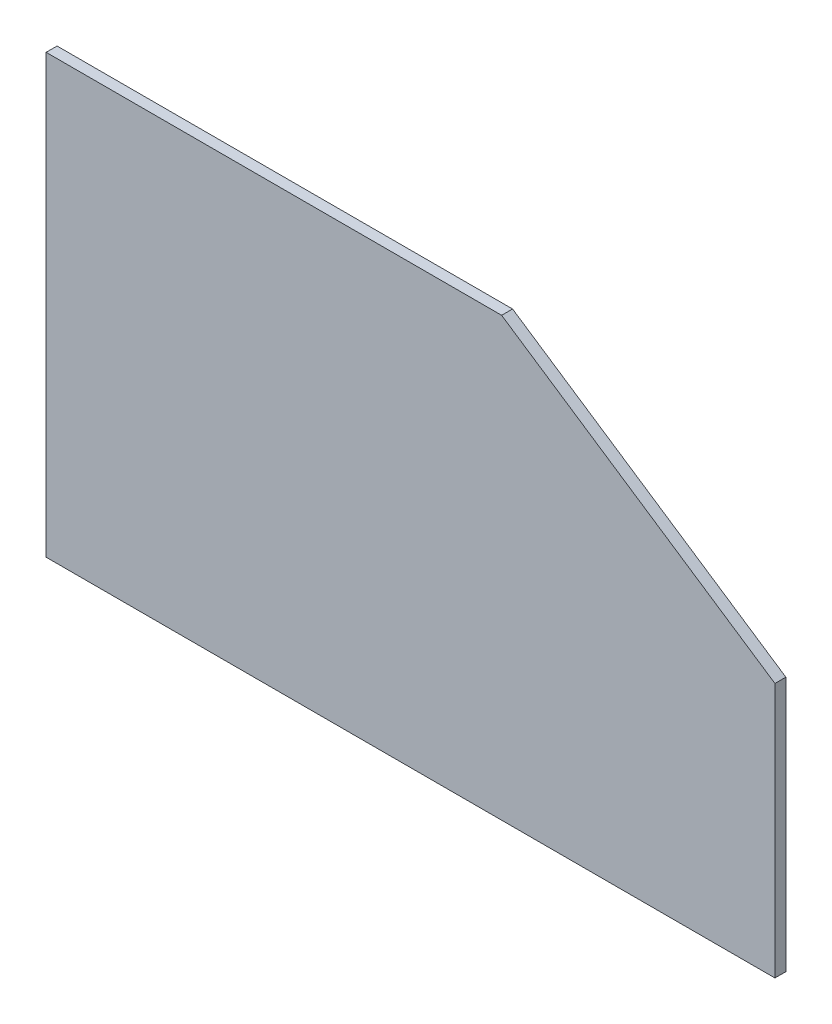
ISO-10303-21;
HEADER;
FILE_DESCRIPTION(('STEP AP214'),'2;1');
FILE_NAME('part.step','',(''),(''),'','','');
FILE_SCHEMA(('AUTOMOTIVE_DESIGN { 1 0 10303 214 1 1 1 1 }'));
ENDSEC;
DATA;
#1=APPLICATION_CONTEXT('core data for automotive mechanical design processes');
#2=APPLICATION_PROTOCOL_DEFINITION('international standard','automotive_design',2000,#1);
#3=PRODUCT_CONTEXT('',#1,'mechanical');
#4=PRODUCT('Part','Part','',(#3));
#5=PRODUCT_RELATED_PRODUCT_CATEGORY('part','',(#4));
#6=PRODUCT_DEFINITION_FORMATION('','',#4);
#7=PRODUCT_DEFINITION_CONTEXT('part definition',#1,'design');
#8=PRODUCT_DEFINITION('design','',#6,#7);
#9=PRODUCT_DEFINITION_SHAPE('','',#8);
#10=(LENGTH_UNIT() NAMED_UNIT(*) SI_UNIT(.MILLI.,.METRE.));
#11=(NAMED_UNIT(*) PLANE_ANGLE_UNIT() SI_UNIT($,.RADIAN.));
#12=(NAMED_UNIT(*) SI_UNIT($,.STERADIAN.) SOLID_ANGLE_UNIT());
#13=UNCERTAINTY_MEASURE_WITH_UNIT(LENGTH_MEASURE(1.E-05),#10,'distance_accuracy_value','');
#14=(GEOMETRIC_REPRESENTATION_CONTEXT(3) GLOBAL_UNCERTAINTY_ASSIGNED_CONTEXT((#13)) GLOBAL_UNIT_ASSIGNED_CONTEXT((#10,
#11,#12)) REPRESENTATION_CONTEXT('',''));
#15=CARTESIAN_POINT('',(0.,0.,0.));
#16=DIRECTION('',(0.,0.,1.));
#17=DIRECTION('',(1.,0.,0.));
#18=AXIS2_PLACEMENT_3D('',#15,#16,#17);
#19=CARTESIAN_POINT('',(200.,0.,3.));
#20=DIRECTION('',(0.,1.,0.));
#21=DIRECTION('',(0.,0.,1.));
#22=AXIS2_PLACEMENT_3D('',#19,#20,#21);
#23=PLANE('',#22);
#24=DIRECTION('',(1.,0.,0.));
#25=VECTOR('',#24,1.);
#26=CARTESIAN_POINT('',(200.,0.,0.));
#27=LINE('',#26,#25);
#28=CARTESIAN_POINT('',(0.,0.,0.));
#29=VERTEX_POINT('',#28);
#30=CARTESIAN_POINT('',(200.,0.,0.));
#31=VERTEX_POINT('',#30);
#32=EDGE_CURVE('E118',#29,#31,#27,.T.);
#33=ORIENTED_EDGE('',*,*,#32,.T.);
#34=DIRECTION('',(0.,0.,-1.));
#35=VECTOR('',#34,1.);
#36=CARTESIAN_POINT('',(200.,0.,3.));
#37=LINE('',#36,#35);
#38=CARTESIAN_POINT('',(200.,0.,3.));
#39=VERTEX_POINT('',#38);
#40=EDGE_CURVE('E11',#39,#31,#37,.T.);
#41=ORIENTED_EDGE('',*,*,#40,.F.);
#42=DIRECTION('',(1.,0.,0.));
#43=VECTOR('',#42,1.);
#44=CARTESIAN_POINT('',(200.,0.,3.));
#45=LINE('',#44,#43);
#46=CARTESIAN_POINT('',(0.,0.,3.));
#47=VERTEX_POINT('',#46);
#48=EDGE_CURVE('E131',#47,#39,#45,.T.);
#49=ORIENTED_EDGE('',*,*,#48,.F.);
#50=DIRECTION('',(0.,0.,-1.));
#51=VECTOR('',#50,1.);
#52=CARTESIAN_POINT('',(0.,0.,3.));
#53=LINE('',#52,#51);
#54=EDGE_CURVE('E114',#47,#29,#53,.T.);
#55=ORIENTED_EDGE('',*,*,#54,.T.);
#56=EDGE_LOOP('',(#33,#41,#49,#55));
#57=FACE_BOUND('',#56,.T.);
#58=ADVANCED_FACE('F39',(#57),#23,.F.);
#59=CARTESIAN_POINT('',(200.,70.,3.));
#60=DIRECTION('',(-1.,0.,0.));
#61=DIRECTION('',(0.,0.,1.));
#62=AXIS2_PLACEMENT_3D('',#59,#60,#61);
#63=PLANE('',#62);
#64=DIRECTION('',(0.,1.,0.));
#65=VECTOR('',#64,1.);
#66=CARTESIAN_POINT('',(200.,70.,0.));
#67=LINE('',#66,#65);
#68=CARTESIAN_POINT('',(200.,70.,0.));
#69=VERTEX_POINT('',#68);
#70=EDGE_CURVE('E122',#31,#69,#67,.T.);
#71=ORIENTED_EDGE('',*,*,#70,.T.);
#72=DIRECTION('',(0.,0.,-1.));
#73=VECTOR('',#72,1.);
#74=CARTESIAN_POINT('',(200.,70.,3.));
#75=LINE('',#74,#73);
#76=CARTESIAN_POINT('',(200.,70.,3.));
#77=VERTEX_POINT('',#76);
#78=EDGE_CURVE('E48',#77,#69,#75,.T.);
#79=ORIENTED_EDGE('',*,*,#78,.F.);
#80=DIRECTION('',(0.,1.,0.));
#81=VECTOR('',#80,1.);
#82=CARTESIAN_POINT('',(200.,70.,3.));
#83=LINE('',#82,#81);
#84=EDGE_CURVE('E90',#39,#77,#83,.T.);
#85=ORIENTED_EDGE('',*,*,#84,.F.);
#86=ORIENTED_EDGE('',*,*,#40,.T.);
#87=EDGE_LOOP('',(#71,#79,#85,#86));
#88=FACE_BOUND('',#87,.T.);
#89=ADVANCED_FACE('F153',(#88),#63,.F.);
#90=CARTESIAN_POINT('',(125.,120.,3.));
#91=DIRECTION('',(-0.554700196225229,-0.832050294337844,0.));
#92=DIRECTION('',(0.832050294337844,-0.554700196225229,0.));
#93=AXIS2_PLACEMENT_3D('',#90,#91,#92);
#94=PLANE('',#93);
#95=DIRECTION('',(-0.832050294337844,0.554700196225229,0.));
#96=VECTOR('',#95,1.);
#97=CARTESIAN_POINT('',(125.,120.,0.));
#98=LINE('',#97,#96);
#99=CARTESIAN_POINT('',(125.,120.,0.));
#100=VERTEX_POINT('',#99);
#101=EDGE_CURVE('E106',#69,#100,#98,.T.);
#102=ORIENTED_EDGE('',*,*,#101,.T.);
#103=DIRECTION('',(0.,0.,-1.));
#104=VECTOR('',#103,1.);
#105=CARTESIAN_POINT('',(125.,120.,3.));
#106=LINE('',#105,#104);
#107=CARTESIAN_POINT('',(125.,120.,3.));
#108=VERTEX_POINT('',#107);
#109=EDGE_CURVE('E103',#108,#100,#106,.T.);
#110=ORIENTED_EDGE('',*,*,#109,.F.);
#111=DIRECTION('',(-0.832050294337844,0.554700196225229,0.));
#112=VECTOR('',#111,1.);
#113=CARTESIAN_POINT('',(125.,120.,3.));
#114=LINE('',#113,#112);
#115=EDGE_CURVE('E94',#77,#108,#114,.T.);
#116=ORIENTED_EDGE('',*,*,#115,.F.);
#117=ORIENTED_EDGE('',*,*,#78,.T.);
#118=EDGE_LOOP('',(#102,#110,#116,#117));
#119=FACE_BOUND('',#118,.T.);
#120=ADVANCED_FACE('F104',(#119),#94,.F.);
#121=CARTESIAN_POINT('',(0.,120.,3.));
#122=DIRECTION('',(0.,-1.,0.));
#123=DIRECTION('',(0.,0.,-1.));
#124=AXIS2_PLACEMENT_3D('',#121,#122,#123);
#125=PLANE('',#124);
#126=DIRECTION('',(-1.,0.,0.));
#127=VECTOR('',#126,1.);
#128=CARTESIAN_POINT('',(0.,120.,0.));
#129=LINE('',#128,#127);
#130=CARTESIAN_POINT('',(0.,120.,0.));
#131=VERTEX_POINT('',#130);
#132=EDGE_CURVE('E76',#100,#131,#129,.T.);
#133=ORIENTED_EDGE('',*,*,#132,.T.);
#134=DIRECTION('',(0.,0.,-1.));
#135=VECTOR('',#134,1.);
#136=CARTESIAN_POINT('',(0.,120.,3.));
#137=LINE('',#136,#135);
#138=CARTESIAN_POINT('',(0.,120.,3.));
#139=VERTEX_POINT('',#138);
#140=EDGE_CURVE('E108',#139,#131,#137,.T.);
#141=ORIENTED_EDGE('',*,*,#140,.F.);
#142=DIRECTION('',(-1.,0.,0.));
#143=VECTOR('',#142,1.);
#144=CARTESIAN_POINT('',(0.,120.,3.));
#145=LINE('',#144,#143);
#146=EDGE_CURVE('E98',#108,#139,#145,.T.);
#147=ORIENTED_EDGE('',*,*,#146,.F.);
#148=ORIENTED_EDGE('',*,*,#109,.T.);
#149=EDGE_LOOP('',(#133,#141,#147,#148));
#150=FACE_BOUND('',#149,.T.);
#151=ADVANCED_FACE('F110',(#150),#125,.F.);
#152=CARTESIAN_POINT('',(0.,0.,3.));
#153=DIRECTION('',(1.,0.,0.));
#154=DIRECTION('',(0.,0.,-1.));
#155=AXIS2_PLACEMENT_3D('',#152,#153,#154);
#156=PLANE('',#155);
#157=DIRECTION('',(0.,-1.,0.));
#158=VECTOR('',#157,1.);
#159=CARTESIAN_POINT('',(0.,0.,0.));
#160=LINE('',#159,#158);
#161=EDGE_CURVE('E82',#131,#29,#160,.T.);
#162=ORIENTED_EDGE('',*,*,#161,.T.);
#163=ORIENTED_EDGE('',*,*,#54,.F.);
#164=DIRECTION('',(0.,-1.,0.));
#165=VECTOR('',#164,1.);
#166=CARTESIAN_POINT('',(0.,0.,3.));
#167=LINE('',#166,#165);
#168=EDGE_CURVE('E56',#139,#47,#167,.T.);
#169=ORIENTED_EDGE('',*,*,#168,.F.);
#170=ORIENTED_EDGE('',*,*,#140,.T.);
#171=EDGE_LOOP('',(#162,#163,#169,#170));
#172=FACE_BOUND('',#171,.T.);
#173=ADVANCED_FACE('F142',(#172),#156,.F.);
#174=CARTESIAN_POINT('',(0.,0.,3.));
#175=DIRECTION('',(0.,0.,-1.));
#176=DIRECTION('',(-1.,0.,0.));
#177=AXIS2_PLACEMENT_3D('',#174,#175,#176);
#178=PLANE('',#177);
#179=ORIENTED_EDGE('',*,*,#48,.T.);
#180=ORIENTED_EDGE('',*,*,#84,.T.);
#181=ORIENTED_EDGE('',*,*,#115,.T.);
#182=ORIENTED_EDGE('',*,*,#146,.T.);
#183=ORIENTED_EDGE('',*,*,#168,.T.);
#184=EDGE_LOOP('',(#179,#180,#181,#182,#183));
#185=FACE_BOUND('',#184,.T.);
#186=ADVANCED_FACE('F96',(#185),#178,.F.);
#187=CARTESIAN_POINT('',(0.,0.,0.));
#188=DIRECTION('',(0.,0.,-1.));
#189=DIRECTION('',(-1.,0.,0.));
#190=AXIS2_PLACEMENT_3D('',#187,#188,#189);
#191=PLANE('',#190);
#192=ORIENTED_EDGE('',*,*,#32,.F.);
#193=ORIENTED_EDGE('',*,*,#161,.F.);
#194=ORIENTED_EDGE('',*,*,#132,.F.);
#195=ORIENTED_EDGE('',*,*,#101,.F.);
#196=ORIENTED_EDGE('',*,*,#70,.F.);
#197=EDGE_LOOP('',(#192,#193,#194,#195,#196));
#198=FACE_BOUND('',#197,.T.);
#199=ADVANCED_FACE('F138',(#198),#191,.T.);
#200=CLOSED_SHELL('',(#58,#89,#120,#151,#173,#186,#199));
#201=MANIFOLD_SOLID_BREP('B2',#200);
#202=ADVANCED_BREP_SHAPE_REPRESENTATION('',(#18,#201),#14);
#203=SHAPE_DEFINITION_REPRESENTATION(#9,#202);
ENDSEC;
END-ISO-10303-21;
